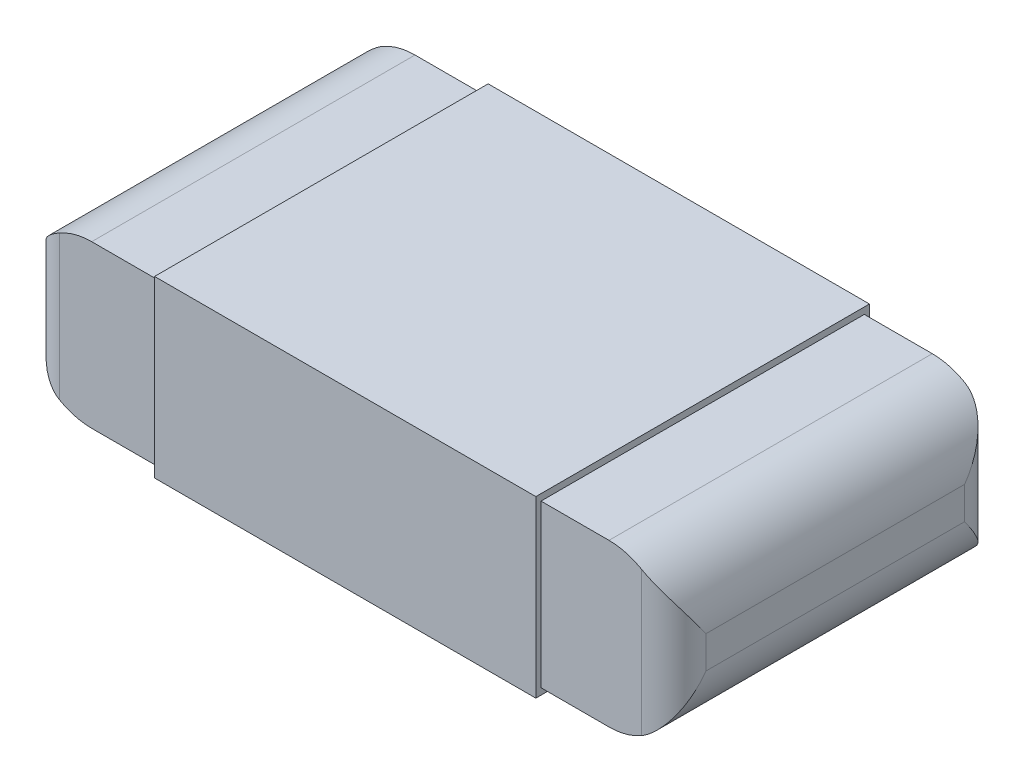
ISO-10303-21;
HEADER;
FILE_DESCRIPTION(('STEP AP214'),'2;1');
FILE_NAME('part.step','',(''),(''),'','','');
FILE_SCHEMA(('AUTOMOTIVE_DESIGN { 1 0 10303 214 1 1 1 1 }'));
ENDSEC;
DATA;
#1=APPLICATION_CONTEXT('core data for automotive mechanical design processes');
#2=APPLICATION_PROTOCOL_DEFINITION('international standard','automotive_design',2000,#1);
#3=PRODUCT_CONTEXT('',#1,'mechanical');
#4=PRODUCT('Part','Part','',(#3));
#5=PRODUCT_RELATED_PRODUCT_CATEGORY('part','',(#4));
#6=PRODUCT_DEFINITION_FORMATION('','',#4);
#7=PRODUCT_DEFINITION_CONTEXT('part definition',#1,'design');
#8=PRODUCT_DEFINITION('design','',#6,#7);
#9=PRODUCT_DEFINITION_SHAPE('','',#8);
#10=(LENGTH_UNIT() NAMED_UNIT(*) SI_UNIT(.MILLI.,.METRE.));
#11=(NAMED_UNIT(*) PLANE_ANGLE_UNIT() SI_UNIT($,.RADIAN.));
#12=(NAMED_UNIT(*) SI_UNIT($,.STERADIAN.) SOLID_ANGLE_UNIT());
#13=UNCERTAINTY_MEASURE_WITH_UNIT(LENGTH_MEASURE(1.E-05),#10,'distance_accuracy_value','');
#14=(GEOMETRIC_REPRESENTATION_CONTEXT(3) GLOBAL_UNCERTAINTY_ASSIGNED_CONTEXT((#13)) GLOBAL_UNIT_ASSIGNED_CONTEXT((#10,
#11,#12)) REPRESENTATION_CONTEXT('',''));
#15=CARTESIAN_POINT('',(0.,0.,0.));
#16=DIRECTION('',(0.,0.,1.));
#17=DIRECTION('',(1.,0.,0.));
#18=AXIS2_PLACEMENT_3D('',#15,#16,#17);
#19=CARTESIAN_POINT('',(0.8,0.2,-0.4));
#20=DIRECTION('',(0.,0.,1.));
#21=DIRECTION('',(1.,0.,0.));
#22=AXIS2_PLACEMENT_3D('',#19,#20,#21);
#23=CYLINDRICAL_SURFACE('',#22,0.2);
#24=DIRECTION('',(0.,0.,1.));
#25=VECTOR('',#24,1.);
#26=CARTESIAN_POINT('',(0.8,0.,-0.4));
#27=LINE('',#26,#25);
#28=CARTESIAN_POINT('',(0.8,0.,-0.5));
#29=VERTEX_POINT('',#28);
#30=CARTESIAN_POINT('',(0.8,0.,0.5));
#31=VERTEX_POINT('',#30);
#32=EDGE_CURVE('E425',#29,#31,#27,.T.);
#33=ORIENTED_EDGE('',*,*,#32,.F.);
#34=CARTESIAN_POINT('',(0.8,0.2,-0.5));
#35=DIRECTION('',(0.,0.,1.));
#36=DIRECTION('',(1.,0.,0.));
#37=AXIS2_PLACEMENT_3D('',#34,#35,#36);
#38=CIRCLE('',#37,0.2);
#39=CARTESIAN_POINT('',(0.9,0.0267949192431119,-0.5));
#40=VERTEX_POINT('',#39);
#41=EDGE_CURVE('E11',#40,#29,#38,.F.);
#42=ORIENTED_EDGE('',*,*,#41,.F.);
#43=CARTESIAN_POINT('',(1.,0.2,-0.4));
#44=CARTESIAN_POINT('',(0.999999983072864,0.199230265206249,-0.400544282228111));
#45=CARTESIAN_POINT('',(0.999995541202412,0.198460451756178,-0.401088622862475));
#46=CARTESIAN_POINT('',(0.999830887032167,0.184177662084119,-0.411187615032353));
#47=CARTESIAN_POINT('',(0.998309293335564,0.170648651777436,-0.42074580386039));
#48=CARTESIAN_POINT('',(0.992439986724433,0.143823568259094,-0.43937667897669));
#49=CARTESIAN_POINT('',(0.98808787706933,0.130527890543944,-0.448448586136543));
#50=CARTESIAN_POINT('',(0.978413726347984,0.109153021932256,-0.46241488568885));
#51=CARTESIAN_POINT('',(0.973980771771668,0.100893709996313,-0.467651073702682));
#52=CARTESIAN_POINT('',(0.963752288084721,0.0847785475000898,-0.47736480297489));
#53=CARTESIAN_POINT('',(0.957958993410414,0.0769220607875098,-0.481843567810438));
#54=CARTESIAN_POINT('',(0.946635924149842,0.0637931196837576,-0.488637538008042));
#55=CARTESIAN_POINT('',(0.941427649475718,0.0583790368532122,-0.491212599871301));
#56=CARTESIAN_POINT('',(0.930251988431801,0.0480393288393203,-0.495501165724608));
#57=CARTESIAN_POINT('',(0.924287628102556,0.0431118886731781,-0.497217976192737));
#58=CARTESIAN_POINT('',(0.913067382860577,0.0349165169726395,-0.499267806020897));
#59=CARTESIAN_POINT('',(0.90794590833421,0.0315224086708144,-0.499822688027607));
#60=CARTESIAN_POINT('',(0.897355279759922,0.0251826195740271,-0.500107053145928));
#61=CARTESIAN_POINT('',(0.891883539774665,0.0222409969733048,-0.4998294780729));
#62=CARTESIAN_POINT('',(0.886315504292947,0.0195848295772936,-0.49905924781283));
#63=B_SPLINE_CURVE_WITH_KNOTS('',3,(#43,#44,#45,#46,#47,#48,#49,#50,#51,#52,#53,#54,#55,#56,#57,
#58,#59,#60,#61,#62),.UNSPECIFIED.,.F.,.F.,(4,2,2,2,2,2,2,2,2,4),(0.,0.00282845855442077,
0.0524744517280808,0.102197746558004,0.134314800305417,0.166379464493683,0.190126137040758,
0.213780604789976,0.232211386664833,0.250798878839497),.UNSPECIFIED.);
#64=CARTESIAN_POINT('',(1.,0.2,-0.399999999999999));
#65=VERTEX_POINT('',#64);
#66=EDGE_CURVE('E40',#65,#40,#63,.T.);
#67=ORIENTED_EDGE('',*,*,#66,.F.);
#68=DIRECTION('',(0.,0.,1.));
#69=VECTOR('',#68,1.);
#70=CARTESIAN_POINT('',(1.,0.2,0.399999999999999));
#71=LINE('',#70,#69);
#72=CARTESIAN_POINT('',(1.,0.2,0.399999999999999));
#73=VERTEX_POINT('',#72);
#74=EDGE_CURVE('E405',#73,#65,#71,.F.);
#75=ORIENTED_EDGE('',*,*,#74,.F.);
#76=CARTESIAN_POINT('',(0.9,0.0267949192431119,0.5));
#77=CARTESIAN_POINT('',(0.907514309596764,0.0311205308065121,0.49999114219976));
#78=CARTESIAN_POINT('',(0.914673441502378,0.0359164514148719,0.499157306983901));
#79=CARTESIAN_POINT('',(0.928074806543108,0.0461632162907768,0.496220763666264));
#80=CARTESIAN_POINT('',(0.934328249724067,0.0516041964333537,0.494135581701895));
#81=CARTESIAN_POINT('',(0.947028408978722,0.0640701843654364,0.488573465620422));
#82=CARTESIAN_POINT('',(0.953284812859025,0.071199452052429,0.484907022231131));
#83=CARTESIAN_POINT('',(0.964566473084106,0.0859619950617503,0.476682196882224));
#84=CARTESIAN_POINT('',(0.969584022293407,0.0935980681680662,0.472118533641544));
#85=CARTESIAN_POINT('',(0.98020674979206,0.11234089640212,0.460432880727702));
#86=CARTESIAN_POINT('',(0.985225624856394,0.123599763502786,0.453023746296428));
#87=CARTESIAN_POINT('',(0.99306365207464,0.14641091773769,0.437601493017153));
#88=CARTESIAN_POINT('',(0.995885789426559,0.157962784572652,0.429589210107819));
#89=CARTESIAN_POINT('',(0.999110416127171,0.178923226480421,0.414898864262181));
#90=CARTESIAN_POINT('',(0.999878389826028,0.188308747215672,0.408266611515612));
#91=CARTESIAN_POINT('',(0.99999555080957,0.198460423973697,0.401088644129542));
#92=CARTESIAN_POINT('',(0.999999993658988,0.199230237064579,0.400544303926148));
#93=CARTESIAN_POINT('',(1.,0.2,0.4));
#94=B_SPLINE_CURVE_WITH_KNOTS('',3,(#76,#77,#78,#79,#80,#81,#82,#83,#84,#85,#86,#87,#88,#89,#90,
#91,#92,#93),.UNSPECIFIED.,.F.,.F.,(4,2,2,2,2,2,2,2,4),(0.,0.0258484357675781,
0.0513430265915882,0.0816965683541472,0.11223443863043,0.155151467051329,0.198010072209763,
0.23247985222331,0.235308310777731),.UNSPECIFIED.);
#95=CARTESIAN_POINT('',(0.9,0.0267949192431119,0.5));
#96=VERTEX_POINT('',#95);
#97=EDGE_CURVE('E397',#96,#73,#94,.T.);
#98=ORIENTED_EDGE('',*,*,#97,.F.);
#99=CARTESIAN_POINT('',(0.8,0.2,0.5));
#100=DIRECTION('',(0.,0.,-1.));
#101=DIRECTION('',(-1.,0.,0.));
#102=AXIS2_PLACEMENT_3D('',#99,#100,#101);
#103=CIRCLE('',#102,0.2);
#104=EDGE_CURVE('E406',#31,#96,#103,.F.);
#105=ORIENTED_EDGE('',*,*,#104,.F.);
#106=EDGE_LOOP('',(#33,#42,#67,#75,#98,#105));
#107=FACE_BOUND('',#106,.T.);
#108=ADVANCED_FACE('F32',(#107),#23,.T.);
#109=CARTESIAN_POINT('',(0.8,0.3,0.399999999999999));
#110=DIRECTION('',(0.,0.,-1.));
#111=DIRECTION('',(-1.,0.,0.));
#112=AXIS2_PLACEMENT_3D('',#109,#110,#111);
#113=CYLINDRICAL_SURFACE('',#112,0.2);
#114=DIRECTION('',(0.,0.,1.));
#115=VECTOR('',#114,1.);
#116=CARTESIAN_POINT('',(1.,0.3,0.399999999999999));
#117=LINE('',#116,#115);
#118=CARTESIAN_POINT('',(1.,0.3,-0.399999999999999));
#119=VERTEX_POINT('',#118);
#120=CARTESIAN_POINT('',(1.,0.3,0.399999999999999));
#121=VERTEX_POINT('',#120);
#122=EDGE_CURVE('E372',#119,#121,#117,.T.);
#123=ORIENTED_EDGE('',*,*,#122,.F.);
#124=CARTESIAN_POINT('',(0.9,0.473205080756888,-0.5));
#125=CARTESIAN_POINT('',(0.907514309596764,0.468879469193488,-0.49999114219976));
#126=CARTESIAN_POINT('',(0.914673441502378,0.464083548585128,-0.499157306983901));
#127=CARTESIAN_POINT('',(0.928074806543108,0.453836783709223,-0.496220763666265));
#128=CARTESIAN_POINT('',(0.934328249724067,0.448395803566646,-0.494135581701895));
#129=CARTESIAN_POINT('',(0.947028408978722,0.435929815634564,-0.488573465620423));
#130=CARTESIAN_POINT('',(0.953284812859025,0.428800547947571,-0.484907022231132));
#131=CARTESIAN_POINT('',(0.964566473084106,0.41403800493825,-0.476682196882224));
#132=CARTESIAN_POINT('',(0.969584022293407,0.406401931831934,-0.472118533641545));
#133=CARTESIAN_POINT('',(0.98020674979206,0.38765910359788,-0.460432880727702));
#134=CARTESIAN_POINT('',(0.985225624856394,0.376400236497214,-0.453023746296428));
#135=CARTESIAN_POINT('',(0.99306365207464,0.35358908226231,-0.437601493017154));
#136=CARTESIAN_POINT('',(0.995885789426559,0.342037215427349,-0.429589210107819));
#137=CARTESIAN_POINT('',(0.999110416127171,0.321076773519578,-0.414898864262181));
#138=CARTESIAN_POINT('',(0.999878389826028,0.311691252784328,-0.408266611515613));
#139=CARTESIAN_POINT('',(0.99999555080957,0.301539576026303,-0.401088644129542));
#140=CARTESIAN_POINT('',(0.999999993658988,0.300769762935421,-0.400544303926149));
#141=CARTESIAN_POINT('',(1.,0.3,-0.4));
#142=B_SPLINE_CURVE_WITH_KNOTS('',3,(#124,#125,#126,#127,#128,#129,#130,#131,#132,#133,#134,
#135,#136,#137,#138,#139,#140,#141),.UNSPECIFIED.,.F.,.F.,(4,2,2,2,2,2,2,2,4),(0.,
0.0258484357675782,0.0513430265915882,0.0816965683541472,0.11223443863043,0.15515146705133,
0.198010072209763,0.23247985222331,0.235308310777731),.UNSPECIFIED.);
#143=CARTESIAN_POINT('',(0.9,0.473205080756888,-0.5));
#144=VERTEX_POINT('',#143);
#145=EDGE_CURVE('E419',#144,#119,#142,.T.);
#146=ORIENTED_EDGE('',*,*,#145,.F.);
#147=CARTESIAN_POINT('',(0.8,0.3,-0.5));
#148=DIRECTION('',(0.,0.,1.));
#149=DIRECTION('',(1.,0.,0.));
#150=AXIS2_PLACEMENT_3D('',#147,#148,#149);
#151=CIRCLE('',#150,0.2);
#152=CARTESIAN_POINT('',(0.8,0.5,-0.5));
#153=VERTEX_POINT('',#152);
#154=EDGE_CURVE('E426',#153,#144,#151,.F.);
#155=ORIENTED_EDGE('',*,*,#154,.F.);
#156=DIRECTION('',(0.,0.,1.));
#157=VECTOR('',#156,1.);
#158=CARTESIAN_POINT('',(0.8,0.5,0.399999999999999));
#159=LINE('',#158,#157);
#160=CARTESIAN_POINT('',(0.8,0.5,0.5));
#161=VERTEX_POINT('',#160);
#162=EDGE_CURVE('E438',#161,#153,#159,.F.);
#163=ORIENTED_EDGE('',*,*,#162,.F.);
#164=CARTESIAN_POINT('',(0.8,0.3,0.5));
#165=DIRECTION('',(0.,0.,-1.));
#166=DIRECTION('',(-1.,0.,0.));
#167=AXIS2_PLACEMENT_3D('',#164,#165,#166);
#168=CIRCLE('',#167,0.2);
#169=CARTESIAN_POINT('',(0.9,0.473205080756888,0.5));
#170=VERTEX_POINT('',#169);
#171=EDGE_CURVE('E380',#170,#161,#168,.F.);
#172=ORIENTED_EDGE('',*,*,#171,.F.);
#173=CARTESIAN_POINT('',(1.,0.3,0.4));
#174=CARTESIAN_POINT('',(0.999999983072864,0.300769734793751,0.400544282228111));
#175=CARTESIAN_POINT('',(0.999995541202412,0.301539548243822,0.401088622862475));
#176=CARTESIAN_POINT('',(0.999830887032167,0.315822337915881,0.411187615032352));
#177=CARTESIAN_POINT('',(0.998309293335564,0.329351348222564,0.420745803860389));
#178=CARTESIAN_POINT('',(0.992439986724433,0.356176431740906,0.43937667897669));
#179=CARTESIAN_POINT('',(0.98808787706933,0.369472109456056,0.448448586136543));
#180=CARTESIAN_POINT('',(0.978413726347984,0.390846978067744,0.462414885688849));
#181=CARTESIAN_POINT('',(0.973980771771668,0.399106290003687,0.467651073702682));
#182=CARTESIAN_POINT('',(0.963752288084721,0.41522145249991,0.477364802974889));
#183=CARTESIAN_POINT('',(0.957958993410414,0.42307793921249,0.481843567810437));
#184=CARTESIAN_POINT('',(0.946635924149842,0.436206880316242,0.488637538008041));
#185=CARTESIAN_POINT('',(0.941427649475718,0.441620963146788,0.491212599871301));
#186=CARTESIAN_POINT('',(0.930251988431801,0.45196067116068,0.495501165724607));
#187=CARTESIAN_POINT('',(0.924287628102556,0.456888111326822,0.497217976192736));
#188=CARTESIAN_POINT('',(0.913067382860577,0.46508348302736,0.499267806020896));
#189=CARTESIAN_POINT('',(0.90794590833421,0.468477591329186,0.499822688027607));
#190=CARTESIAN_POINT('',(0.897355279759922,0.474817380425973,0.500107053145928));
#191=CARTESIAN_POINT('',(0.891883539774665,0.477759003026695,0.499829478072899));
#192=CARTESIAN_POINT('',(0.886315504292947,0.480415170422707,0.49905924781283));
#193=B_SPLINE_CURVE_WITH_KNOTS('',3,(#173,#174,#175,#176,#177,#178,#179,#180,#181,#182,#183,
#184,#185,#186,#187,#188,#189,#190,#191,#192),.UNSPECIFIED.,.F.,.F.,(4,2,2,2,2,2,2,2,2,4),(0.,
0.00282845855442072,0.0524744517280809,0.102197746558004,0.134314800305417,0.166379464493683,
0.190126137040758,0.213780604789976,0.232211386664833,0.250798878839498),.UNSPECIFIED.);
#194=EDGE_CURVE('E374',#121,#170,#193,.T.);
#195=ORIENTED_EDGE('',*,*,#194,.F.);
#196=EDGE_LOOP('',(#123,#146,#155,#163,#172,#195));
#197=FACE_BOUND('',#196,.T.);
#198=ADVANCED_FACE('F310',(#197),#113,.T.);
#199=CARTESIAN_POINT('',(-0.8,0.3,-0.4));
#200=DIRECTION('',(0.,0.,-1.));
#201=DIRECTION('',(-1.,0.,0.));
#202=AXIS2_PLACEMENT_3D('',#199,#200,#201);
#203=CYLINDRICAL_SURFACE('',#202,0.2);
#204=DIRECTION('',(0.,0.,1.));
#205=VECTOR('',#204,1.);
#206=CARTESIAN_POINT('',(-0.8,0.5,-0.4));
#207=LINE('',#206,#205);
#208=CARTESIAN_POINT('',(-0.8,0.5,-0.5));
#209=VERTEX_POINT('',#208);
#210=CARTESIAN_POINT('',(-0.8,0.5,0.5));
#211=VERTEX_POINT('',#210);
#212=EDGE_CURVE('E339',#209,#211,#207,.T.);
#213=ORIENTED_EDGE('',*,*,#212,.F.);
#214=CARTESIAN_POINT('',(-0.8,0.3,-0.5));
#215=DIRECTION('',(0.,0.,1.));
#216=DIRECTION('',(1.,0.,0.));
#217=AXIS2_PLACEMENT_3D('',#214,#215,#216);
#218=CIRCLE('',#217,0.2);
#219=CARTESIAN_POINT('',(-0.899999999999999,0.473205080756888,-0.5));
#220=VERTEX_POINT('',#219);
#221=EDGE_CURVE('E303',#220,#209,#218,.F.);
#222=ORIENTED_EDGE('',*,*,#221,.F.);
#223=CARTESIAN_POINT('',(-1.,0.3,-0.4));
#224=CARTESIAN_POINT('',(-0.999999983072863,0.300769734793752,-0.400544282228109));
#225=CARTESIAN_POINT('',(-0.999995541202412,0.301539548243825,-0.401088622862471));
#226=CARTESIAN_POINT('',(-0.999830887032167,0.315822337915897,-0.411187615032317));
#227=CARTESIAN_POINT('',(-0.998309293335565,0.329351348222558,-0.420745803860372));
#228=CARTESIAN_POINT('',(-0.992439986724439,0.356176431740876,-0.439376678976681));
#229=CARTESIAN_POINT('',(-0.988087877069341,0.369472109456025,-0.448448586136524));
#230=CARTESIAN_POINT('',(-0.978413726348,0.390846978067713,-0.462414885688828));
#231=CARTESIAN_POINT('',(-0.973980771771684,0.399106290003659,-0.467651073702664));
#232=CARTESIAN_POINT('',(-0.963752288084736,0.415221452499889,-0.477364802974877));
#233=CARTESIAN_POINT('',(-0.957958993410428,0.423077939212473,-0.481843567810428));
#234=CARTESIAN_POINT('',(-0.946635924149854,0.436206880316229,-0.488637538008035));
#235=CARTESIAN_POINT('',(-0.941427649475731,0.441620963146775,-0.491212599871295));
#236=CARTESIAN_POINT('',(-0.930251988431814,0.451960671160668,-0.495501165724603));
#237=CARTESIAN_POINT('',(-0.92428762810257,0.456888111326811,-0.497217976192733));
#238=CARTESIAN_POINT('',(-0.913067382860592,0.465083483027351,-0.499267806020895));
#239=CARTESIAN_POINT('',(-0.907945908334224,0.468477591329176,-0.499822688027605));
#240=CARTESIAN_POINT('',(-0.897355279759936,0.474817380425965,-0.500107053145929));
#241=CARTESIAN_POINT('',(-0.891883539774678,0.477759003026688,-0.499829478072901));
#242=CARTESIAN_POINT('',(-0.88631550429296,0.4804151704227,-0.499059247812832));
#243=B_SPLINE_CURVE_WITH_KNOTS('',3,(#223,#224,#225,#226,#227,#228,#229,#230,#231,#232,#233,
#234,#235,#236,#237,#238,#239,#240,#241,#242),.UNSPECIFIED.,.F.,.F.,(4,2,2,2,2,2,2,2,2,4),(0.,
0.00282845855442077,0.0524744517280582,0.102197746557958,0.134314800305384,0.166379464493663,
0.190126137040739,0.213780604789958,0.232211386664816,0.250798878839483),.UNSPECIFIED.);
#244=CARTESIAN_POINT('',(-1.,0.3,-0.399999999999999));
#245=VERTEX_POINT('',#244);
#246=EDGE_CURVE('E295',#245,#220,#243,.T.);
#247=ORIENTED_EDGE('',*,*,#246,.F.);
#248=DIRECTION('',(0.,0.,1.));
#249=VECTOR('',#248,1.);
#250=CARTESIAN_POINT('',(-1.,0.3,-0.4));
#251=LINE('',#250,#249);
#252=CARTESIAN_POINT('',(-1.,0.3,0.399999999999999));
#253=VERTEX_POINT('',#252);
#254=EDGE_CURVE('E304',#253,#245,#251,.F.);
#255=ORIENTED_EDGE('',*,*,#254,.F.);
#256=CARTESIAN_POINT('',(-0.899999999999999,0.473205080756888,0.5));
#257=CARTESIAN_POINT('',(-0.907514309596763,0.468879469193488,0.49999114219976));
#258=CARTESIAN_POINT('',(-0.914673441502378,0.464083548585128,0.499157306983901));
#259=CARTESIAN_POINT('',(-0.928074806543108,0.453836783709223,0.496220763666265));
#260=CARTESIAN_POINT('',(-0.934328249724067,0.448395803566646,0.494135581701895));
#261=CARTESIAN_POINT('',(-0.947028408978721,0.435929815634564,0.488573465620423));
#262=CARTESIAN_POINT('',(-0.953284812859025,0.428800547947571,0.484907022231132));
#263=CARTESIAN_POINT('',(-0.964566473084106,0.41403800493825,0.476682196882224));
#264=CARTESIAN_POINT('',(-0.969584022293407,0.406401931831934,0.472118533641545));
#265=CARTESIAN_POINT('',(-0.98020674979206,0.387659103597881,0.460432880727702));
#266=CARTESIAN_POINT('',(-0.985225624856394,0.376400236497215,0.453023746296426));
#267=CARTESIAN_POINT('',(-0.99306365207464,0.353589082262308,0.437601493017156));
#268=CARTESIAN_POINT('',(-0.995885789426559,0.342037215427343,0.429589210107827));
#269=CARTESIAN_POINT('',(-0.99911041612717,0.321076773519583,0.414898864262174));
#270=CARTESIAN_POINT('',(-0.999878389826027,0.311691252784343,0.408266611515591));
#271=CARTESIAN_POINT('',(-0.99999555080957,0.301539576026305,0.401088644129539));
#272=CARTESIAN_POINT('',(-0.999999993658988,0.300769762935422,0.400544303926147));
#273=CARTESIAN_POINT('',(-1.,0.3,0.4));
#274=B_SPLINE_CURVE_WITH_KNOTS('',3,(#256,#257,#258,#259,#260,#261,#262,#263,#264,#265,#266,
#267,#268,#269,#270,#271,#272,#273),.UNSPECIFIED.,.F.,.F.,(4,2,2,2,2,2,2,2,4),(0.,
0.0258484357675785,0.0513430265915882,0.0816965683541469,0.11223443863043,0.15515146705133,
0.198010072209762,0.23247985222331,0.235308310777731),.UNSPECIFIED.);
#275=CARTESIAN_POINT('',(-0.899999999999999,0.473205080756888,0.5));
#276=VERTEX_POINT('',#275);
#277=EDGE_CURVE('E314',#276,#253,#274,.T.);
#278=ORIENTED_EDGE('',*,*,#277,.F.);
#279=CARTESIAN_POINT('',(-0.8,0.3,0.5));
#280=DIRECTION('',(0.,0.,-1.));
#281=DIRECTION('',(-1.,0.,0.));
#282=AXIS2_PLACEMENT_3D('',#279,#280,#281);
#283=CIRCLE('',#282,0.2);
#284=EDGE_CURVE('E321',#211,#276,#283,.F.);
#285=ORIENTED_EDGE('',*,*,#284,.F.);
#286=EDGE_LOOP('',(#213,#222,#247,#255,#278,#285));
#287=FACE_BOUND('',#286,.T.);
#288=ADVANCED_FACE('F307',(#287),#203,.T.);
#289=CARTESIAN_POINT('',(-0.8,0.2,-0.4));
#290=DIRECTION('',(0.,0.,-1.));
#291=DIRECTION('',(-1.,0.,0.));
#292=AXIS2_PLACEMENT_3D('',#289,#290,#291);
#293=CYLINDRICAL_SURFACE('',#292,0.2);
#294=DIRECTION('',(0.,0.,-1.));
#295=VECTOR('',#294,1.);
#296=CARTESIAN_POINT('',(-0.8,0.,-0.4));
#297=LINE('',#296,#295);
#298=CARTESIAN_POINT('',(-0.8,0.,0.5));
#299=VERTEX_POINT('',#298);
#300=CARTESIAN_POINT('',(-0.8,0.,-0.5));
#301=VERTEX_POINT('',#300);
#302=EDGE_CURVE('E262',#299,#301,#297,.T.);
#303=ORIENTED_EDGE('',*,*,#302,.F.);
#304=CARTESIAN_POINT('',(-0.8,0.2,0.5));
#305=DIRECTION('',(0.,0.,-1.));
#306=DIRECTION('',(-1.,0.,0.));
#307=AXIS2_PLACEMENT_3D('',#304,#305,#306);
#308=CIRCLE('',#307,0.2);
#309=CARTESIAN_POINT('',(-0.899999999999999,0.0267949192431118,0.5));
#310=VERTEX_POINT('',#309);
#311=EDGE_CURVE('E338',#310,#299,#308,.F.);
#312=ORIENTED_EDGE('',*,*,#311,.F.);
#313=CARTESIAN_POINT('',(-1.,0.2,0.4));
#314=CARTESIAN_POINT('',(-0.999999983072863,0.199230265206248,0.400544282228109));
#315=CARTESIAN_POINT('',(-0.999995541202412,0.198460451756175,0.401088622862471));
#316=CARTESIAN_POINT('',(-0.999830887032167,0.184177662084103,0.411187615032317));
#317=CARTESIAN_POINT('',(-0.998309293335565,0.170648651777442,0.420745803860372));
#318=CARTESIAN_POINT('',(-0.992439986724439,0.143823568259124,0.439376678976681));
#319=CARTESIAN_POINT('',(-0.988087877069341,0.130527890543975,0.448448586136524));
#320=CARTESIAN_POINT('',(-0.978413726348,0.109153021932287,0.462414885688828));
#321=CARTESIAN_POINT('',(-0.973980771771684,0.100893709996341,0.467651073702664));
#322=CARTESIAN_POINT('',(-0.963752288084736,0.0847785475001111,0.477364802974878));
#323=CARTESIAN_POINT('',(-0.957958993410428,0.0769220607875273,0.481843567810428));
#324=CARTESIAN_POINT('',(-0.946635924149854,0.0637931196837711,0.488637538008035));
#325=CARTESIAN_POINT('',(-0.941427649475731,0.0583790368532253,0.491212599871295));
#326=CARTESIAN_POINT('',(-0.930251988431814,0.0480393288393323,0.495501165724603));
#327=CARTESIAN_POINT('',(-0.92428762810257,0.0431118886731894,0.497217976192733));
#328=CARTESIAN_POINT('',(-0.913067382860592,0.0349165169726495,0.499267806020895));
#329=CARTESIAN_POINT('',(-0.907945908334224,0.0315224086708236,0.499822688027606));
#330=CARTESIAN_POINT('',(-0.897355279759936,0.0251826195740348,0.500107053145929));
#331=CARTESIAN_POINT('',(-0.891883539774678,0.0222409969733118,0.499829478072901));
#332=CARTESIAN_POINT('',(-0.88631550429296,0.0195848295772997,0.499059247812832));
#333=B_SPLINE_CURVE_WITH_KNOTS('',3,(#313,#314,#315,#316,#317,#318,#319,#320,#321,#322,#323,
#324,#325,#326,#327,#328,#329,#330,#331,#332),.UNSPECIFIED.,.F.,.F.,(4,2,2,2,2,2,2,2,2,4),(0.,
0.00282845855442074,0.0524744517280583,0.102197746557958,0.134314800305384,0.166379464493663,
0.190126137040739,0.213780604789958,0.232211386664816,0.250798878839483),.UNSPECIFIED.);
#334=CARTESIAN_POINT('',(-1.,0.2,0.399999999999999));
#335=VERTEX_POINT('',#334);
#336=EDGE_CURVE('E331',#335,#310,#333,.T.);
#337=ORIENTED_EDGE('',*,*,#336,.F.);
#338=DIRECTION('',(0.,0.,-1.));
#339=VECTOR('',#338,1.);
#340=CARTESIAN_POINT('',(-1.,0.2,0.399999999999999));
#341=LINE('',#340,#339);
#342=CARTESIAN_POINT('',(-1.,0.2,-0.399999999999999));
#343=VERTEX_POINT('',#342);
#344=EDGE_CURVE('E277',#343,#335,#341,.F.);
#345=ORIENTED_EDGE('',*,*,#344,.F.);
#346=CARTESIAN_POINT('',(-0.899999999999999,0.0267949192431118,-0.5));
#347=CARTESIAN_POINT('',(-0.907514309596763,0.0311205308065121,-0.49999114219976));
#348=CARTESIAN_POINT('',(-0.914673441502378,0.0359164514148719,-0.499157306983901));
#349=CARTESIAN_POINT('',(-0.928074806543108,0.0461632162907769,-0.496220763666264));
#350=CARTESIAN_POINT('',(-0.934328249724067,0.0516041964333537,-0.494135581701895));
#351=CARTESIAN_POINT('',(-0.947028408978721,0.0640701843654362,-0.488573465620423));
#352=CARTESIAN_POINT('',(-0.953284812859025,0.0711994520524287,-0.484907022231131));
#353=CARTESIAN_POINT('',(-0.964566473084106,0.0859619950617501,-0.476682196882224));
#354=CARTESIAN_POINT('',(-0.969584022293407,0.0935980681680663,-0.472118533641545));
#355=CARTESIAN_POINT('',(-0.98020674979206,0.112340896402119,-0.460432880727701));
#356=CARTESIAN_POINT('',(-0.985225624856394,0.123599763502785,-0.453023746296426));
#357=CARTESIAN_POINT('',(-0.99306365207464,0.146410917737692,-0.437601493017156));
#358=CARTESIAN_POINT('',(-0.995885789426559,0.157962784572657,-0.429589210107827));
#359=CARTESIAN_POINT('',(-0.99911041612717,0.178923226480417,-0.414898864262174));
#360=CARTESIAN_POINT('',(-0.999878389826027,0.188308747215656,-0.40826661151559));
#361=CARTESIAN_POINT('',(-0.99999555080957,0.198460423973695,-0.401088644129539));
#362=CARTESIAN_POINT('',(-0.999999993658988,0.199230237064578,-0.400544303926147));
#363=CARTESIAN_POINT('',(-1.,0.2,-0.4));
#364=B_SPLINE_CURVE_WITH_KNOTS('',3,(#346,#347,#348,#349,#350,#351,#352,#353,#354,#355,#356,
#357,#358,#359,#360,#361,#362,#363),.UNSPECIFIED.,.F.,.F.,(4,2,2,2,2,2,2,2,4),(0.,
0.0258484357675785,0.0513430265915882,0.0816965683541469,0.11223443863043,0.15515146705133,
0.198010072209762,0.23247985222331,0.235308310777731),.UNSPECIFIED.);
#365=CARTESIAN_POINT('',(-0.899999999999999,0.0267949192431118,-0.5));
#366=VERTEX_POINT('',#365);
#367=EDGE_CURVE('E268',#366,#343,#364,.T.);
#368=ORIENTED_EDGE('',*,*,#367,.F.);
#369=CARTESIAN_POINT('',(-0.8,0.2,-0.5));
#370=DIRECTION('',(0.,0.,1.));
#371=DIRECTION('',(1.,0.,0.));
#372=AXIS2_PLACEMENT_3D('',#369,#370,#371);
#373=CIRCLE('',#372,0.2);
#374=EDGE_CURVE('E265',#301,#366,#373,.F.);
#375=ORIENTED_EDGE('',*,*,#374,.F.);
#376=EDGE_LOOP('',(#303,#312,#337,#345,#368,#375));
#377=FACE_BOUND('',#376,.T.);
#378=ADVANCED_FACE('F279',(#377),#293,.T.);
#379=CARTESIAN_POINT('',(0.9,0.5,-0.5));
#380=DIRECTION('',(0.,0.,1.));
#381=DIRECTION('',(1.,0.,0.));
#382=AXIS2_PLACEMENT_3D('',#379,#380,#381);
#383=PLANE('',#382);
#384=DIRECTION('',(0.,-1.,0.));
#385=VECTOR('',#384,1.);
#386=CARTESIAN_POINT('',(-0.899999999999999,0.5,-0.5));
#387=LINE('',#386,#385);
#388=EDGE_CURVE('E251',#220,#366,#387,.T.);
#389=ORIENTED_EDGE('',*,*,#388,.F.);
#390=ORIENTED_EDGE('',*,*,#221,.T.);
#391=DIRECTION('',(-1.,0.,0.));
#392=VECTOR('',#391,1.);
#393=CARTESIAN_POINT('',(0.9,0.5,-0.5));
#394=LINE('',#393,#392);
#395=CARTESIAN_POINT('',(-0.589686710846138,0.5,-0.5));
#396=VERTEX_POINT('',#395);
#397=EDGE_CURVE('E228',#396,#209,#394,.T.);
#398=ORIENTED_EDGE('',*,*,#397,.F.);
#399=DIRECTION('',(0.,-1.,0.));
#400=VECTOR('',#399,1.);
#401=CARTESIAN_POINT('',(-0.589686710846138,0.5,-0.5));
#402=LINE('',#401,#400);
#403=CARTESIAN_POINT('',(-0.589686710846138,0.,-0.5));
#404=VERTEX_POINT('',#403);
#405=EDGE_CURVE('E218',#396,#404,#402,.T.);
#406=ORIENTED_EDGE('',*,*,#405,.T.);
#407=DIRECTION('',(-1.,0.,0.));
#408=VECTOR('',#407,1.);
#409=CARTESIAN_POINT('',(0.9,0.,-0.5));
#410=LINE('',#409,#408);
#411=EDGE_CURVE('E224',#404,#301,#410,.T.);
#412=ORIENTED_EDGE('',*,*,#411,.T.);
#413=ORIENTED_EDGE('',*,*,#374,.T.);
#414=EDGE_LOOP('',(#389,#390,#398,#406,#412,#413));
#415=FACE_BOUND('',#414,.T.);
#416=ADVANCED_FACE('F363',(#415),#383,.F.);
#417=CARTESIAN_POINT('',(0.9,0.5,0.5));
#418=DIRECTION('',(0.,0.,-1.));
#419=DIRECTION('',(-1.,0.,0.));
#420=AXIS2_PLACEMENT_3D('',#417,#418,#419);
#421=PLANE('',#420);
#422=DIRECTION('',(1.,0.,0.));
#423=VECTOR('',#422,1.);
#424=CARTESIAN_POINT('',(0.9,0.5,0.5));
#425=LINE('',#424,#423);
#426=CARTESIAN_POINT('',(-0.589686710846138,0.5,0.5));
#427=VERTEX_POINT('',#426);
#428=EDGE_CURVE('E229',#211,#427,#425,.T.);
#429=ORIENTED_EDGE('',*,*,#428,.F.);
#430=ORIENTED_EDGE('',*,*,#284,.T.);
#431=DIRECTION('',(0.,-1.,0.));
#432=VECTOR('',#431,1.);
#433=CARTESIAN_POINT('',(-0.899999999999999,0.5,0.5));
#434=LINE('',#433,#432);
#435=EDGE_CURVE('E245',#276,#310,#434,.T.);
#436=ORIENTED_EDGE('',*,*,#435,.T.);
#437=ORIENTED_EDGE('',*,*,#311,.T.);
#438=DIRECTION('',(1.,0.,0.));
#439=VECTOR('',#438,1.);
#440=CARTESIAN_POINT('',(0.9,0.,0.5));
#441=LINE('',#440,#439);
#442=CARTESIAN_POINT('',(-0.589686710846138,0.,0.5));
#443=VERTEX_POINT('',#442);
#444=EDGE_CURVE('E235',#299,#443,#441,.T.);
#445=ORIENTED_EDGE('',*,*,#444,.T.);
#446=DIRECTION('',(0.,1.,0.));
#447=VECTOR('',#446,1.);
#448=CARTESIAN_POINT('',(-0.589686710846138,0.5,0.5));
#449=LINE('',#448,#447);
#450=EDGE_CURVE('E215',#443,#427,#449,.T.);
#451=ORIENTED_EDGE('',*,*,#450,.T.);
#452=EDGE_LOOP('',(#429,#430,#436,#437,#445,#451));
#453=FACE_BOUND('',#452,.T.);
#454=ADVANCED_FACE('F348',(#453),#421,.F.);
#455=CARTESIAN_POINT('',(0.9,0.5,-0.4));
#456=DIRECTION('',(0.,1.,0.));
#457=DIRECTION('',(0.,0.,1.));
#458=AXIS2_PLACEMENT_3D('',#455,#456,#457);
#459=PLANE('',#458);
#460=ORIENTED_EDGE('',*,*,#397,.T.);
#461=ORIENTED_EDGE('',*,*,#212,.T.);
#462=ORIENTED_EDGE('',*,*,#428,.T.);
#463=DIRECTION('',(0.,0.,1.));
#464=VECTOR('',#463,1.);
#465=CARTESIAN_POINT('',(-0.589686710846138,0.5,-0.4));
#466=LINE('',#465,#464);
#467=EDGE_CURVE('E221',#396,#427,#466,.T.);
#468=ORIENTED_EDGE('',*,*,#467,.F.);
#469=EDGE_LOOP('',(#460,#461,#462,#468));
#470=FACE_BOUND('',#469,.T.);
#471=ADVANCED_FACE('F371',(#470),#459,.T.);
#472=CARTESIAN_POINT('',(0.9,0.,-0.4));
#473=DIRECTION('',(0.,1.,0.));
#474=DIRECTION('',(0.,0.,1.));
#475=AXIS2_PLACEMENT_3D('',#472,#473,#474);
#476=PLANE('',#475);
#477=ORIENTED_EDGE('',*,*,#444,.F.);
#478=ORIENTED_EDGE('',*,*,#302,.T.);
#479=ORIENTED_EDGE('',*,*,#411,.F.);
#480=DIRECTION('',(0.,0.,1.));
#481=VECTOR('',#480,1.);
#482=CARTESIAN_POINT('',(-0.589686710846138,0.,-0.4));
#483=LINE('',#482,#481);
#484=EDGE_CURVE('E259',#404,#443,#483,.T.);
#485=ORIENTED_EDGE('',*,*,#484,.T.);
#486=EDGE_LOOP('',(#477,#478,#479,#485));
#487=FACE_BOUND('',#486,.T.);
#488=ADVANCED_FACE('F289',(#487),#476,.F.);
#489=CARTESIAN_POINT('',(-0.9,0.5,-0.4));
#490=DIRECTION('',(0.,-1.,0.));
#491=DIRECTION('',(0.,0.,-1.));
#492=AXIS2_PLACEMENT_3D('',#489,#490,#491);
#493=CYLINDRICAL_SURFACE('',#492,0.1);
#494=DIRECTION('',(0.,-1.,0.));
#495=VECTOR('',#494,1.);
#496=CARTESIAN_POINT('',(-1.,0.5,-0.399999999999999));
#497=LINE('',#496,#495);
#498=EDGE_CURVE('E249',#245,#343,#497,.T.);
#499=ORIENTED_EDGE('',*,*,#498,.F.);
#500=ORIENTED_EDGE('',*,*,#246,.T.);
#501=ORIENTED_EDGE('',*,*,#388,.T.);
#502=ORIENTED_EDGE('',*,*,#367,.T.);
#503=EDGE_LOOP('',(#499,#500,#501,#502));
#504=FACE_BOUND('',#503,.T.);
#505=ADVANCED_FACE('F283',(#504),#493,.T.);
#506=CARTESIAN_POINT('',(-1.,0.5,0.399999999999999));
#507=DIRECTION('',(1.,0.,0.));
#508=DIRECTION('',(0.,0.,-1.));
#509=AXIS2_PLACEMENT_3D('',#506,#507,#508);
#510=PLANE('',#509);
#511=DIRECTION('',(0.,-1.,0.));
#512=VECTOR('',#511,1.);
#513=CARTESIAN_POINT('',(-1.,0.5,0.399999999999999));
#514=LINE('',#513,#512);
#515=EDGE_CURVE('E247',#253,#335,#514,.T.);
#516=ORIENTED_EDGE('',*,*,#515,.F.);
#517=ORIENTED_EDGE('',*,*,#254,.T.);
#518=ORIENTED_EDGE('',*,*,#498,.T.);
#519=ORIENTED_EDGE('',*,*,#344,.T.);
#520=EDGE_LOOP('',(#516,#517,#518,#519));
#521=FACE_BOUND('',#520,.T.);
#522=ADVANCED_FACE('F288',(#521),#510,.F.);
#523=CARTESIAN_POINT('',(-0.9,0.5,0.4));
#524=DIRECTION('',(0.,-1.,0.));
#525=DIRECTION('',(0.,0.,-1.));
#526=AXIS2_PLACEMENT_3D('',#523,#524,#525);
#527=CYLINDRICAL_SURFACE('',#526,0.1);
#528=ORIENTED_EDGE('',*,*,#435,.F.);
#529=ORIENTED_EDGE('',*,*,#277,.T.);
#530=ORIENTED_EDGE('',*,*,#515,.T.);
#531=ORIENTED_EDGE('',*,*,#336,.T.);
#532=EDGE_LOOP('',(#528,#529,#530,#531));
#533=FACE_BOUND('',#532,.T.);
#534=ADVANCED_FACE('F323',(#533),#527,.T.);
#535=CARTESIAN_POINT('',(-0.589686710846138,-0.0200000000000001,0.515925369910519));
#536=DIRECTION('',(-1.,0.,0.));
#537=DIRECTION('',(0.,0.,1.));
#538=AXIS2_PLACEMENT_3D('',#535,#536,#537);
#539=PLANE('',#538);
#540=ORIENTED_EDGE('',*,*,#405,.F.);
#541=ORIENTED_EDGE('',*,*,#467,.T.);
#542=ORIENTED_EDGE('',*,*,#450,.F.);
#543=ORIENTED_EDGE('',*,*,#484,.F.);
#544=EDGE_LOOP('',(#540,#541,#542,#543));
#545=FACE_BOUND('',#544,.T.);
#546=DIRECTION('',(0.,1.,0.));
#547=VECTOR('',#546,1.);
#548=CARTESIAN_POINT('',(-0.589686710846138,-0.0200000000000001,0.515925369910519));
#549=LINE('',#548,#547);
#550=CARTESIAN_POINT('',(-0.589686710846138,-0.0200000000000001,0.515925369910519));
#551=VERTEX_POINT('',#550);
#552=CARTESIAN_POINT('',(-0.589686710846138,0.52,0.515925369910519));
#553=VERTEX_POINT('',#552);
#554=EDGE_CURVE('E164',#551,#553,#549,.T.);
#555=ORIENTED_EDGE('',*,*,#554,.T.);
#556=DIRECTION('',(0.,0.,1.));
#557=VECTOR('',#556,1.);
#558=CARTESIAN_POINT('',(-0.589686710846138,0.52,0.515925369910519));
#559=LINE('',#558,#557);
#560=CARTESIAN_POINT('',(-0.589686710846138,0.52,-0.515925369910519));
#561=VERTEX_POINT('',#560);
#562=EDGE_CURVE('E168',#561,#553,#559,.T.);
#563=ORIENTED_EDGE('',*,*,#562,.F.);
#564=DIRECTION('',(0.,1.,0.));
#565=VECTOR('',#564,1.);
#566=CARTESIAN_POINT('',(-0.589686710846138,-0.0200000000000001,-0.515925369910519));
#567=LINE('',#566,#565);
#568=CARTESIAN_POINT('',(-0.589686710846138,-0.0200000000000001,-0.515925369910519));
#569=VERTEX_POINT('',#568);
#570=EDGE_CURVE('E201',#569,#561,#567,.T.);
#571=ORIENTED_EDGE('',*,*,#570,.F.);
#572=DIRECTION('',(0.,0.,1.));
#573=VECTOR('',#572,1.);
#574=CARTESIAN_POINT('',(-0.589686710846138,-0.0200000000000001,0.515925369910519));
#575=LINE('',#574,#573);
#576=EDGE_CURVE('E170',#569,#551,#575,.T.);
#577=ORIENTED_EDGE('',*,*,#576,.T.);
#578=EDGE_LOOP('',(#555,#563,#571,#577));
#579=FACE_BOUND('',#578,.T.);
#580=ADVANCED_FACE('F166',(#545,#579),#539,.T.);
#581=CARTESIAN_POINT('',(0.589686710846138,-0.0200000000000001,-0.515925369910519));
#582=DIRECTION('',(0.,0.,-1.));
#583=DIRECTION('',(-1.,0.,0.));
#584=AXIS2_PLACEMENT_3D('',#581,#582,#583);
#585=PLANE('',#584);
#586=ORIENTED_EDGE('',*,*,#570,.T.);
#587=DIRECTION('',(-1.,0.,0.));
#588=VECTOR('',#587,1.);
#589=CARTESIAN_POINT('',(0.589686710846138,0.52,-0.515925369910519));
#590=LINE('',#589,#588);
#591=CARTESIAN_POINT('',(0.589686710846138,0.52,-0.515925369910519));
#592=VERTEX_POINT('',#591);
#593=EDGE_CURVE('E188',#592,#561,#590,.T.);
#594=ORIENTED_EDGE('',*,*,#593,.F.);
#595=DIRECTION('',(0.,1.,0.));
#596=VECTOR('',#595,1.);
#597=CARTESIAN_POINT('',(0.589686710846138,-0.0200000000000001,-0.515925369910519));
#598=LINE('',#597,#596);
#599=CARTESIAN_POINT('',(0.589686710846138,-0.0200000000000001,-0.515925369910519));
#600=VERTEX_POINT('',#599);
#601=EDGE_CURVE('E204',#600,#592,#598,.T.);
#602=ORIENTED_EDGE('',*,*,#601,.F.);
#603=DIRECTION('',(-1.,0.,0.));
#604=VECTOR('',#603,1.);
#605=CARTESIAN_POINT('',(0.589686710846138,-0.0200000000000001,-0.515925369910519));
#606=LINE('',#605,#604);
#607=EDGE_CURVE('E175',#600,#569,#606,.T.);
#608=ORIENTED_EDGE('',*,*,#607,.T.);
#609=EDGE_LOOP('',(#586,#594,#602,#608));
#610=FACE_BOUND('',#609,.T.);
#611=ADVANCED_FACE('F504',(#610),#585,.T.);
#612=CARTESIAN_POINT('',(0.589686710846138,-0.0200000000000001,0.515925369910519));
#613=DIRECTION('',(1.,0.,0.));
#614=DIRECTION('',(0.,0.,-1.));
#615=AXIS2_PLACEMENT_3D('',#612,#613,#614);
#616=PLANE('',#615);
#617=DIRECTION('',(0.,-1.,0.));
#618=VECTOR('',#617,1.);
#619=CARTESIAN_POINT('',(0.589686710846138,0.5,0.5));
#620=LINE('',#619,#618);
#621=CARTESIAN_POINT('',(0.589686710846138,0.5,0.5));
#622=VERTEX_POINT('',#621);
#623=CARTESIAN_POINT('',(0.589686710846138,0.,0.5));
#624=VERTEX_POINT('',#623);
#625=EDGE_CURVE('E203',#622,#624,#620,.T.);
#626=ORIENTED_EDGE('',*,*,#625,.F.);
#627=DIRECTION('',(0.,0.,-1.));
#628=VECTOR('',#627,1.);
#629=CARTESIAN_POINT('',(0.589686710846138,0.5,-0.4));
#630=LINE('',#629,#628);
#631=CARTESIAN_POINT('',(0.589686710846138,0.5,-0.5));
#632=VERTEX_POINT('',#631);
#633=EDGE_CURVE('E212',#622,#632,#630,.T.);
#634=ORIENTED_EDGE('',*,*,#633,.T.);
#635=DIRECTION('',(0.,1.,0.));
#636=VECTOR('',#635,1.);
#637=CARTESIAN_POINT('',(0.589686710846138,0.5,-0.5));
#638=LINE('',#637,#636);
#639=CARTESIAN_POINT('',(0.589686710846138,0.,-0.5));
#640=VERTEX_POINT('',#639);
#641=EDGE_CURVE('E209',#640,#632,#638,.T.);
#642=ORIENTED_EDGE('',*,*,#641,.F.);
#643=DIRECTION('',(0.,0.,-1.));
#644=VECTOR('',#643,1.);
#645=CARTESIAN_POINT('',(0.589686710846138,0.,-0.4));
#646=LINE('',#645,#644);
#647=EDGE_CURVE('E256',#624,#640,#646,.T.);
#648=ORIENTED_EDGE('',*,*,#647,.F.);
#649=EDGE_LOOP('',(#626,#634,#642,#648));
#650=FACE_BOUND('',#649,.T.);
#651=ORIENTED_EDGE('',*,*,#601,.T.);
#652=DIRECTION('',(0.,0.,-1.));
#653=VECTOR('',#652,1.);
#654=CARTESIAN_POINT('',(0.589686710846138,0.52,0.515925369910519));
#655=LINE('',#654,#653);
#656=CARTESIAN_POINT('',(0.589686710846138,0.52,0.515925369910519));
#657=VERTEX_POINT('',#656);
#658=EDGE_CURVE('E183',#657,#592,#655,.T.);
#659=ORIENTED_EDGE('',*,*,#658,.F.);
#660=DIRECTION('',(0.,1.,0.));
#661=VECTOR('',#660,1.);
#662=CARTESIAN_POINT('',(0.589686710846138,-0.0200000000000001,0.515925369910519));
#663=LINE('',#662,#661);
#664=CARTESIAN_POINT('',(0.589686710846138,-0.0200000000000001,0.515925369910519));
#665=VERTEX_POINT('',#664);
#666=EDGE_CURVE('E174',#665,#657,#663,.T.);
#667=ORIENTED_EDGE('',*,*,#666,.F.);
#668=DIRECTION('',(0.,0.,-1.));
#669=VECTOR('',#668,1.);
#670=CARTESIAN_POINT('',(0.589686710846138,-0.0200000000000001,0.515925369910519));
#671=LINE('',#670,#669);
#672=EDGE_CURVE('E196',#665,#600,#671,.T.);
#673=ORIENTED_EDGE('',*,*,#672,.T.);
#674=EDGE_LOOP('',(#651,#659,#667,#673));
#675=FACE_BOUND('',#674,.T.);
#676=ADVANCED_FACE('F511',(#650,#675),#616,.T.);
#677=CARTESIAN_POINT('',(0.589686710846138,-0.0200000000000001,0.515925369910519));
#678=DIRECTION('',(0.,0.,1.));
#679=DIRECTION('',(1.,0.,0.));
#680=AXIS2_PLACEMENT_3D('',#677,#678,#679);
#681=PLANE('',#680);
#682=ORIENTED_EDGE('',*,*,#666,.T.);
#683=DIRECTION('',(1.,0.,0.));
#684=VECTOR('',#683,1.);
#685=CARTESIAN_POINT('',(0.589686710846138,0.52,0.515925369910519));
#686=LINE('',#685,#684);
#687=EDGE_CURVE('E178',#553,#657,#686,.T.);
#688=ORIENTED_EDGE('',*,*,#687,.F.);
#689=ORIENTED_EDGE('',*,*,#554,.F.);
#690=DIRECTION('',(1.,0.,0.));
#691=VECTOR('',#690,1.);
#692=CARTESIAN_POINT('',(0.589686710846138,-0.0200000000000001,0.515925369910519));
#693=LINE('',#692,#691);
#694=EDGE_CURVE('E194',#551,#665,#693,.T.);
#695=ORIENTED_EDGE('',*,*,#694,.T.);
#696=EDGE_LOOP('',(#682,#688,#689,#695));
#697=FACE_BOUND('',#696,.T.);
#698=ADVANCED_FACE('F179',(#697),#681,.T.);
#699=CARTESIAN_POINT('',(0.,-0.0200000000000001,0.));
#700=DIRECTION('',(0.,1.,0.));
#701=DIRECTION('',(0.,0.,1.));
#702=AXIS2_PLACEMENT_3D('',#699,#700,#701);
#703=PLANE('',#702);
#704=ORIENTED_EDGE('',*,*,#576,.F.);
#705=ORIENTED_EDGE('',*,*,#607,.F.);
#706=ORIENTED_EDGE('',*,*,#672,.F.);
#707=ORIENTED_EDGE('',*,*,#694,.F.);
#708=EDGE_LOOP('',(#704,#705,#706,#707));
#709=FACE_BOUND('',#708,.T.);
#710=ADVANCED_FACE('F526',(#709),#703,.F.);
#711=CARTESIAN_POINT('',(0.,0.52,0.));
#712=DIRECTION('',(0.,1.,0.));
#713=DIRECTION('',(0.,0.,1.));
#714=AXIS2_PLACEMENT_3D('',#711,#712,#713);
#715=PLANE('',#714);
#716=ORIENTED_EDGE('',*,*,#562,.T.);
#717=ORIENTED_EDGE('',*,*,#687,.T.);
#718=ORIENTED_EDGE('',*,*,#658,.T.);
#719=ORIENTED_EDGE('',*,*,#593,.T.);
#720=EDGE_LOOP('',(#716,#717,#718,#719));
#721=FACE_BOUND('',#720,.T.);
#722=ADVANCED_FACE('F186',(#721),#715,.T.);
#723=CARTESIAN_POINT('',(0.9,0.5,0.4));
#724=DIRECTION('',(0.,-1.,0.));
#725=DIRECTION('',(0.,0.,-1.));
#726=AXIS2_PLACEMENT_3D('',#723,#724,#725);
#727=CYLINDRICAL_SURFACE('',#726,0.1);
#728=DIRECTION('',(0.,-1.,0.));
#729=VECTOR('',#728,1.);
#730=CARTESIAN_POINT('',(0.9,0.5,0.5));
#731=LINE('',#730,#729);
#732=EDGE_CURVE('E242',#170,#96,#731,.T.);
#733=ORIENTED_EDGE('',*,*,#732,.T.);
#734=ORIENTED_EDGE('',*,*,#97,.T.);
#735=DIRECTION('',(0.,-1.,0.));
#736=VECTOR('',#735,1.);
#737=CARTESIAN_POINT('',(1.,0.5,0.399999999999999));
#738=LINE('',#737,#736);
#739=EDGE_CURVE('E239',#121,#73,#738,.T.);
#740=ORIENTED_EDGE('',*,*,#739,.F.);
#741=ORIENTED_EDGE('',*,*,#194,.T.);
#742=EDGE_LOOP('',(#733,#734,#740,#741));
#743=FACE_BOUND('',#742,.T.);
#744=ADVANCED_FACE('F388',(#743),#727,.T.);
#745=CARTESIAN_POINT('',(1.,0.5,0.399999999999999));
#746=DIRECTION('',(-1.,0.,0.));
#747=DIRECTION('',(0.,0.,1.));
#748=AXIS2_PLACEMENT_3D('',#745,#746,#747);
#749=PLANE('',#748);
#750=ORIENTED_EDGE('',*,*,#739,.T.);
#751=ORIENTED_EDGE('',*,*,#74,.T.);
#752=DIRECTION('',(0.,-1.,0.));
#753=VECTOR('',#752,1.);
#754=CARTESIAN_POINT('',(1.,0.5,-0.399999999999999));
#755=LINE('',#754,#753);
#756=EDGE_CURVE('E231',#119,#65,#755,.T.);
#757=ORIENTED_EDGE('',*,*,#756,.F.);
#758=ORIENTED_EDGE('',*,*,#122,.T.);
#759=EDGE_LOOP('',(#750,#751,#757,#758));
#760=FACE_BOUND('',#759,.T.);
#761=ADVANCED_FACE('F392',(#760),#749,.F.);
#762=CARTESIAN_POINT('',(0.9,0.5,-0.4));
#763=DIRECTION('',(0.,-1.,0.));
#764=DIRECTION('',(0.,0.,-1.));
#765=AXIS2_PLACEMENT_3D('',#762,#763,#764);
#766=CYLINDRICAL_SURFACE('',#765,0.1);
#767=ORIENTED_EDGE('',*,*,#756,.T.);
#768=ORIENTED_EDGE('',*,*,#66,.T.);
#769=DIRECTION('',(0.,-1.,0.));
#770=VECTOR('',#769,1.);
#771=CARTESIAN_POINT('',(0.9,0.5,-0.5));
#772=LINE('',#771,#770);
#773=EDGE_CURVE('E253',#144,#40,#772,.T.);
#774=ORIENTED_EDGE('',*,*,#773,.F.);
#775=ORIENTED_EDGE('',*,*,#145,.T.);
#776=EDGE_LOOP('',(#767,#768,#774,#775));
#777=FACE_BOUND('',#776,.T.);
#778=ADVANCED_FACE('F412',(#777),#766,.T.);
#779=EDGE_CURVE('E232',#29,#640,#410,.T.);
#780=ORIENTED_EDGE('',*,*,#779,.F.);
#781=ORIENTED_EDGE('',*,*,#32,.T.);
#782=EDGE_CURVE('E234',#624,#31,#441,.T.);
#783=ORIENTED_EDGE('',*,*,#782,.F.);
#784=ORIENTED_EDGE('',*,*,#647,.T.);
#785=EDGE_LOOP('',(#780,#781,#783,#784));
#786=FACE_BOUND('',#785,.T.);
#787=ADVANCED_FACE('F415',(#786),#476,.F.);
#788=EDGE_CURVE('E227',#622,#161,#425,.T.);
#789=ORIENTED_EDGE('',*,*,#788,.T.);
#790=ORIENTED_EDGE('',*,*,#162,.T.);
#791=EDGE_CURVE('E225',#153,#632,#394,.T.);
#792=ORIENTED_EDGE('',*,*,#791,.T.);
#793=ORIENTED_EDGE('',*,*,#633,.F.);
#794=EDGE_LOOP('',(#789,#790,#792,#793));
#795=FACE_BOUND('',#794,.T.);
#796=ADVANCED_FACE('F482',(#795),#459,.T.);
#797=ORIENTED_EDGE('',*,*,#782,.T.);
#798=ORIENTED_EDGE('',*,*,#104,.T.);
#799=ORIENTED_EDGE('',*,*,#732,.F.);
#800=ORIENTED_EDGE('',*,*,#171,.T.);
#801=ORIENTED_EDGE('',*,*,#788,.F.);
#802=ORIENTED_EDGE('',*,*,#625,.T.);
#803=EDGE_LOOP('',(#797,#798,#799,#800,#801,#802));
#804=FACE_BOUND('',#803,.T.);
#805=ADVANCED_FACE('F328',(#804),#421,.F.);
#806=ORIENTED_EDGE('',*,*,#773,.T.);
#807=ORIENTED_EDGE('',*,*,#41,.T.);
#808=ORIENTED_EDGE('',*,*,#779,.T.);
#809=ORIENTED_EDGE('',*,*,#641,.T.);
#810=ORIENTED_EDGE('',*,*,#791,.F.);
#811=ORIENTED_EDGE('',*,*,#154,.T.);
#812=EDGE_LOOP('',(#806,#807,#808,#809,#810,#811));
#813=FACE_BOUND('',#812,.T.);
#814=ADVANCED_FACE('F292',(#813),#383,.F.);
#815=CLOSED_SHELL('',(#108,#198,#288,#378,#416,#454,#471,#488,#505,#522,#534,#580,#611,#676,
#698,#710,#722,#744,#761,#778,#787,#796,#805,#814));
#816=MANIFOLD_SOLID_BREP('B2',#815);
#817=ADVANCED_BREP_SHAPE_REPRESENTATION('',(#18,#816),#14);
#818=SHAPE_DEFINITION_REPRESENTATION(#9,#817);
ENDSEC;
END-ISO-10303-21;
